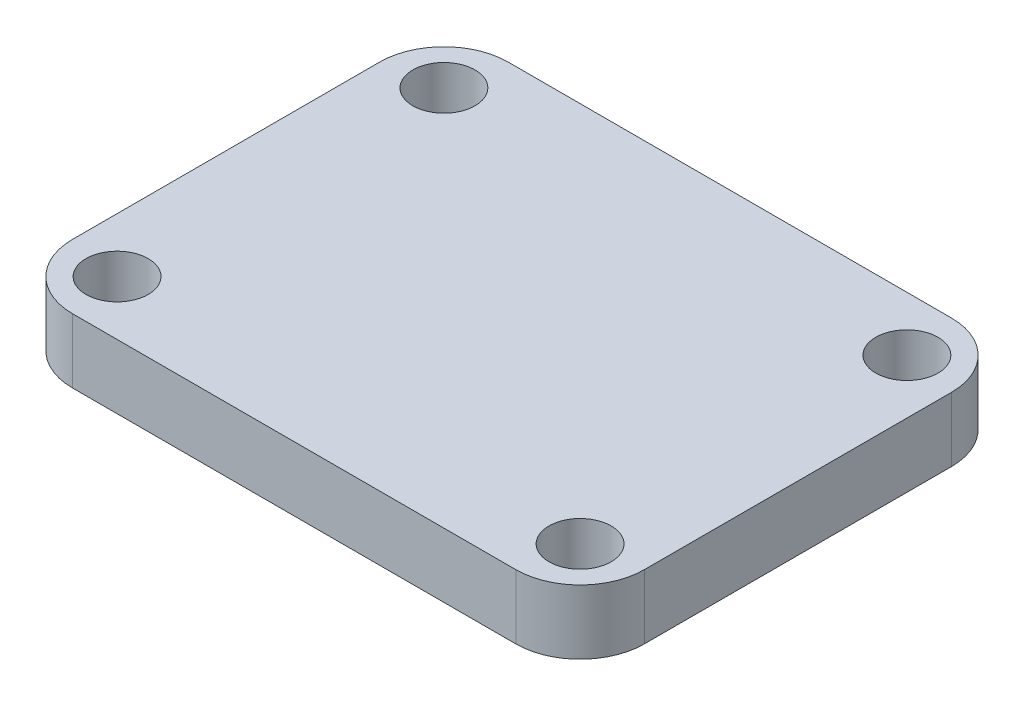
ISO-10303-21;
HEADER;
FILE_DESCRIPTION(('STEP AP214'),'2;1');
FILE_NAME('part.step','',(''),(''),'','','');
FILE_SCHEMA(('AUTOMOTIVE_DESIGN { 1 0 10303 214 1 1 1 1 }'));
ENDSEC;
DATA;
#1=APPLICATION_CONTEXT('core data for automotive mechanical design processes');
#2=APPLICATION_PROTOCOL_DEFINITION('international standard','automotive_design',2000,#1);
#3=PRODUCT_CONTEXT('',#1,'mechanical');
#4=PRODUCT('Part','Part','',(#3));
#5=PRODUCT_RELATED_PRODUCT_CATEGORY('part','',(#4));
#6=PRODUCT_DEFINITION_FORMATION('','',#4);
#7=PRODUCT_DEFINITION_CONTEXT('part definition',#1,'design');
#8=PRODUCT_DEFINITION('design','',#6,#7);
#9=PRODUCT_DEFINITION_SHAPE('','',#8);
#10=(LENGTH_UNIT() NAMED_UNIT(*) SI_UNIT(.MILLI.,.METRE.));
#11=(NAMED_UNIT(*) PLANE_ANGLE_UNIT() SI_UNIT($,.RADIAN.));
#12=(NAMED_UNIT(*) SI_UNIT($,.STERADIAN.) SOLID_ANGLE_UNIT());
#13=UNCERTAINTY_MEASURE_WITH_UNIT(LENGTH_MEASURE(1.E-05),#10,'distance_accuracy_value','');
#14=(GEOMETRIC_REPRESENTATION_CONTEXT(3) GLOBAL_UNCERTAINTY_ASSIGNED_CONTEXT((#13)) GLOBAL_UNIT_ASSIGNED_CONTEXT((#10,
#11,#12)) REPRESENTATION_CONTEXT('',''));
#15=CARTESIAN_POINT('',(0.,0.,0.));
#16=DIRECTION('',(0.,0.,1.));
#17=DIRECTION('',(1.,0.,0.));
#18=AXIS2_PLACEMENT_3D('',#15,#16,#17);
#19=CARTESIAN_POINT('',(0.,3.,0.));
#20=DIRECTION('',(0.,-1.,0.));
#21=DIRECTION('',(0.,0.,-1.));
#22=AXIS2_PLACEMENT_3D('',#19,#20,#21);
#23=PLANE('',#22);
#24=DIRECTION('',(0.,0.,1.));
#25=VECTOR('',#24,1.);
#26=CARTESIAN_POINT('',(-13.335,3.,10.16));
#27=LINE('',#26,#25);
#28=CARTESIAN_POINT('',(-13.335,3.,-7.16));
#29=VERTEX_POINT('',#28);
#30=CARTESIAN_POINT('',(-13.335,3.,7.16));
#31=VERTEX_POINT('',#30);
#32=EDGE_CURVE('E171',#29,#31,#27,.T.);
#33=ORIENTED_EDGE('',*,*,#32,.T.);
#34=CARTESIAN_POINT('',(-10.335,3.,7.16));
#35=DIRECTION('',(0.,-1.,0.));
#36=DIRECTION('',(0.,0.,-1.));
#37=AXIS2_PLACEMENT_3D('',#34,#35,#36);
#38=CIRCLE('',#37,3.);
#39=CARTESIAN_POINT('',(-10.335,3.,10.16));
#40=VERTEX_POINT('',#39);
#41=EDGE_CURVE('E148',#31,#40,#38,.F.);
#42=ORIENTED_EDGE('',*,*,#41,.T.);
#43=DIRECTION('',(1.,0.,0.));
#44=VECTOR('',#43,1.);
#45=CARTESIAN_POINT('',(-13.335,3.,10.16));
#46=LINE('',#45,#44);
#47=CARTESIAN_POINT('',(10.335,3.,10.16));
#48=VERTEX_POINT('',#47);
#49=EDGE_CURVE('E119',#40,#48,#46,.T.);
#50=ORIENTED_EDGE('',*,*,#49,.T.);
#51=CARTESIAN_POINT('',(10.335,3.,7.16));
#52=DIRECTION('',(0.,-1.,0.));
#53=DIRECTION('',(0.,0.,-1.));
#54=AXIS2_PLACEMENT_3D('',#51,#52,#53);
#55=CIRCLE('',#54,3.);
#56=CARTESIAN_POINT('',(13.335,3.,7.16));
#57=VERTEX_POINT('',#56);
#58=EDGE_CURVE('E143',#48,#57,#55,.F.);
#59=ORIENTED_EDGE('',*,*,#58,.T.);
#60=DIRECTION('',(0.,0.,-1.));
#61=VECTOR('',#60,1.);
#62=CARTESIAN_POINT('',(13.335,3.,10.16));
#63=LINE('',#62,#61);
#64=CARTESIAN_POINT('',(13.335,3.,-7.16));
#65=VERTEX_POINT('',#64);
#66=EDGE_CURVE('E126',#57,#65,#63,.T.);
#67=ORIENTED_EDGE('',*,*,#66,.T.);
#68=CARTESIAN_POINT('',(10.335,3.,-7.16));
#69=DIRECTION('',(0.,-1.,0.));
#70=DIRECTION('',(0.,0.,-1.));
#71=AXIS2_PLACEMENT_3D('',#68,#69,#70);
#72=CIRCLE('',#71,3.);
#73=CARTESIAN_POINT('',(10.335,3.,-10.16));
#74=VERTEX_POINT('',#73);
#75=EDGE_CURVE('E55',#65,#74,#72,.F.);
#76=ORIENTED_EDGE('',*,*,#75,.T.);
#77=DIRECTION('',(-1.,0.,0.));
#78=VECTOR('',#77,1.);
#79=CARTESIAN_POINT('',(-13.335,3.,-10.16));
#80=LINE('',#79,#78);
#81=CARTESIAN_POINT('',(-10.335,3.,-10.16));
#82=VERTEX_POINT('',#81);
#83=EDGE_CURVE('E129',#74,#82,#80,.T.);
#84=ORIENTED_EDGE('',*,*,#83,.T.);
#85=CARTESIAN_POINT('',(-10.335,3.,-7.16));
#86=DIRECTION('',(0.,-1.,0.));
#87=DIRECTION('',(0.,0.,-1.));
#88=AXIS2_PLACEMENT_3D('',#85,#86,#87);
#89=CIRCLE('',#88,3.);
#90=EDGE_CURVE('E146',#82,#29,#89,.F.);
#91=ORIENTED_EDGE('',*,*,#90,.T.);
#92=EDGE_LOOP('',(#33,#42,#50,#59,#67,#76,#84,#91));
#93=FACE_BOUND('',#92,.T.);
#94=CARTESIAN_POINT('',(-10.795,3.,-7.62));
#95=DIRECTION('',(0.,1.,0.));
#96=DIRECTION('',(0.,0.,1.));
#97=AXIS2_PLACEMENT_3D('',#94,#95,#96);
#98=CIRCLE('',#97,1.45);
#99=CARTESIAN_POINT('',(-10.795,3.,-6.17));
#100=VERTEX_POINT('',#99);
#101=EDGE_CURVE('E164',#100,#100,#98,.T.);
#102=ORIENTED_EDGE('',*,*,#101,.F.);
#103=EDGE_LOOP('',(#102));
#104=FACE_BOUND('',#103,.T.);
#105=CARTESIAN_POINT('',(-10.795,3.,7.62));
#106=DIRECTION('',(0.,1.,0.));
#107=DIRECTION('',(0.,0.,1.));
#108=AXIS2_PLACEMENT_3D('',#105,#106,#107);
#109=CIRCLE('',#108,1.45);
#110=CARTESIAN_POINT('',(-10.795,3.,9.07));
#111=VERTEX_POINT('',#110);
#112=EDGE_CURVE('E176',#111,#111,#109,.T.);
#113=ORIENTED_EDGE('',*,*,#112,.F.);
#114=EDGE_LOOP('',(#113));
#115=FACE_BOUND('',#114,.T.);
#116=CARTESIAN_POINT('',(10.795,3.,7.62));
#117=DIRECTION('',(0.,1.,0.));
#118=DIRECTION('',(0.,0.,1.));
#119=AXIS2_PLACEMENT_3D('',#116,#117,#118);
#120=CIRCLE('',#119,1.45);
#121=CARTESIAN_POINT('',(10.795,3.,9.07));
#122=VERTEX_POINT('',#121);
#123=EDGE_CURVE('E181',#122,#122,#120,.T.);
#124=ORIENTED_EDGE('',*,*,#123,.F.);
#125=EDGE_LOOP('',(#124));
#126=FACE_BOUND('',#125,.T.);
#127=CARTESIAN_POINT('',(10.795,3.,-7.62));
#128=DIRECTION('',(0.,1.,0.));
#129=DIRECTION('',(0.,0.,1.));
#130=AXIS2_PLACEMENT_3D('',#127,#128,#129);
#131=CIRCLE('',#130,1.45);
#132=CARTESIAN_POINT('',(10.795,3.,-6.17));
#133=VERTEX_POINT('',#132);
#134=EDGE_CURVE('E187',#133,#133,#131,.T.);
#135=ORIENTED_EDGE('',*,*,#134,.F.);
#136=EDGE_LOOP('',(#135));
#137=FACE_BOUND('',#136,.T.);
#138=ADVANCED_FACE('F33',(#93,#104,#115,#126,#137),#23,.F.);
#139=CARTESIAN_POINT('',(0.,0.,0.));
#140=DIRECTION('',(0.,-1.,0.));
#141=DIRECTION('',(0.,0.,-1.));
#142=AXIS2_PLACEMENT_3D('',#139,#140,#141);
#143=PLANE('',#142);
#144=CARTESIAN_POINT('',(10.795,0.,7.62));
#145=DIRECTION('',(0.,1.,0.));
#146=DIRECTION('',(0.,0.,1.));
#147=AXIS2_PLACEMENT_3D('',#144,#145,#146);
#148=CIRCLE('',#147,1.45);
#149=CARTESIAN_POINT('',(10.795,0.,9.07));
#150=VERTEX_POINT('',#149);
#151=EDGE_CURVE('E184',#150,#150,#148,.T.);
#152=ORIENTED_EDGE('',*,*,#151,.T.);
#153=EDGE_LOOP('',(#152));
#154=FACE_BOUND('',#153,.T.);
#155=CARTESIAN_POINT('',(-10.795,0.,-7.62));
#156=DIRECTION('',(0.,1.,0.));
#157=DIRECTION('',(0.,0.,1.));
#158=AXIS2_PLACEMENT_3D('',#155,#156,#157);
#159=CIRCLE('',#158,1.45);
#160=CARTESIAN_POINT('',(-10.795,0.,-6.17));
#161=VERTEX_POINT('',#160);
#162=EDGE_CURVE('E167',#161,#161,#159,.T.);
#163=ORIENTED_EDGE('',*,*,#162,.T.);
#164=EDGE_LOOP('',(#163));
#165=FACE_BOUND('',#164,.T.);
#166=DIRECTION('',(1.,0.,0.));
#167=VECTOR('',#166,1.);
#168=CARTESIAN_POINT('',(-13.335,0.,10.16));
#169=LINE('',#168,#167);
#170=CARTESIAN_POINT('',(-10.335,0.,10.16));
#171=VERTEX_POINT('',#170);
#172=CARTESIAN_POINT('',(10.335,0.,10.16));
#173=VERTEX_POINT('',#172);
#174=EDGE_CURVE('E116',#171,#173,#169,.T.);
#175=ORIENTED_EDGE('',*,*,#174,.F.);
#176=CARTESIAN_POINT('',(-10.335,0.,7.16));
#177=DIRECTION('',(0.,-1.,0.));
#178=DIRECTION('',(0.,0.,-1.));
#179=AXIS2_PLACEMENT_3D('',#176,#177,#178);
#180=CIRCLE('',#179,3.);
#181=CARTESIAN_POINT('',(-13.335,0.,7.16));
#182=VERTEX_POINT('',#181);
#183=EDGE_CURVE('E99',#171,#182,#180,.T.);
#184=ORIENTED_EDGE('',*,*,#183,.T.);
#185=DIRECTION('',(0.,0.,1.));
#186=VECTOR('',#185,1.);
#187=CARTESIAN_POINT('',(-13.335,0.,10.16));
#188=LINE('',#187,#186);
#189=CARTESIAN_POINT('',(-13.335,0.,-7.16));
#190=VERTEX_POINT('',#189);
#191=EDGE_CURVE('E127',#190,#182,#188,.T.);
#192=ORIENTED_EDGE('',*,*,#191,.F.);
#193=CARTESIAN_POINT('',(-10.335,0.,-7.16));
#194=DIRECTION('',(0.,-1.,0.));
#195=DIRECTION('',(0.,0.,-1.));
#196=AXIS2_PLACEMENT_3D('',#193,#194,#195);
#197=CIRCLE('',#196,3.);
#198=CARTESIAN_POINT('',(-10.335,0.,-10.16));
#199=VERTEX_POINT('',#198);
#200=EDGE_CURVE('E110',#190,#199,#197,.T.);
#201=ORIENTED_EDGE('',*,*,#200,.T.);
#202=DIRECTION('',(-1.,0.,0.));
#203=VECTOR('',#202,1.);
#204=CARTESIAN_POINT('',(-13.335,0.,-10.16));
#205=LINE('',#204,#203);
#206=CARTESIAN_POINT('',(10.335,0.,-10.16));
#207=VERTEX_POINT('',#206);
#208=EDGE_CURVE('E131',#207,#199,#205,.T.);
#209=ORIENTED_EDGE('',*,*,#208,.F.);
#210=CARTESIAN_POINT('',(10.335,0.,-7.16));
#211=DIRECTION('',(0.,-1.,0.));
#212=DIRECTION('',(0.,0.,-1.));
#213=AXIS2_PLACEMENT_3D('',#210,#211,#212);
#214=CIRCLE('',#213,3.);
#215=CARTESIAN_POINT('',(13.335,0.,-7.16));
#216=VERTEX_POINT('',#215);
#217=EDGE_CURVE('E137',#207,#216,#214,.T.);
#218=ORIENTED_EDGE('',*,*,#217,.T.);
#219=DIRECTION('',(0.,0.,-1.));
#220=VECTOR('',#219,1.);
#221=CARTESIAN_POINT('',(13.335,0.,10.16));
#222=LINE('',#221,#220);
#223=CARTESIAN_POINT('',(13.335,0.,7.16));
#224=VERTEX_POINT('',#223);
#225=EDGE_CURVE('E159',#224,#216,#222,.T.);
#226=ORIENTED_EDGE('',*,*,#225,.F.);
#227=CARTESIAN_POINT('',(10.335,0.,7.16));
#228=DIRECTION('',(0.,-1.,0.));
#229=DIRECTION('',(0.,0.,-1.));
#230=AXIS2_PLACEMENT_3D('',#227,#228,#229);
#231=CIRCLE('',#230,3.);
#232=EDGE_CURVE('E120',#224,#173,#231,.T.);
#233=ORIENTED_EDGE('',*,*,#232,.T.);
#234=EDGE_LOOP('',(#175,#184,#192,#201,#209,#218,#226,#233));
#235=FACE_BOUND('',#234,.T.);
#236=CARTESIAN_POINT('',(-10.795,0.,7.62));
#237=DIRECTION('',(0.,1.,0.));
#238=DIRECTION('',(0.,0.,1.));
#239=AXIS2_PLACEMENT_3D('',#236,#237,#238);
#240=CIRCLE('',#239,1.45);
#241=CARTESIAN_POINT('',(-10.795,0.,9.07));
#242=VERTEX_POINT('',#241);
#243=EDGE_CURVE('E178',#242,#242,#240,.T.);
#244=ORIENTED_EDGE('',*,*,#243,.T.);
#245=EDGE_LOOP('',(#244));
#246=FACE_BOUND('',#245,.T.);
#247=CARTESIAN_POINT('',(10.795,0.,-7.62));
#248=DIRECTION('',(0.,1.,0.));
#249=DIRECTION('',(0.,0.,1.));
#250=AXIS2_PLACEMENT_3D('',#247,#248,#249);
#251=CIRCLE('',#250,1.45);
#252=CARTESIAN_POINT('',(10.795,0.,-6.17));
#253=VERTEX_POINT('',#252);
#254=EDGE_CURVE('E190',#253,#253,#251,.T.);
#255=ORIENTED_EDGE('',*,*,#254,.T.);
#256=EDGE_LOOP('',(#255));
#257=FACE_BOUND('',#256,.T.);
#258=ADVANCED_FACE('F123',(#154,#165,#235,#246,#257),#143,.T.);
#259=CARTESIAN_POINT('',(13.335,3.,10.16));
#260=DIRECTION('',(-1.,0.,0.));
#261=DIRECTION('',(0.,0.,1.));
#262=AXIS2_PLACEMENT_3D('',#259,#260,#261);
#263=PLANE('',#262);
#264=ORIENTED_EDGE('',*,*,#225,.T.);
#265=DIRECTION('',(0.,-1.,0.));
#266=VECTOR('',#265,1.);
#267=CARTESIAN_POINT('',(13.335,3.,-7.16));
#268=LINE('',#267,#266);
#269=EDGE_CURVE('E11',#216,#65,#268,.F.);
#270=ORIENTED_EDGE('',*,*,#269,.T.);
#271=ORIENTED_EDGE('',*,*,#66,.F.);
#272=DIRECTION('',(0.,-1.,0.));
#273=VECTOR('',#272,1.);
#274=CARTESIAN_POINT('',(13.335,3.,7.16));
#275=LINE('',#274,#273);
#276=EDGE_CURVE('E41',#57,#224,#275,.T.);
#277=ORIENTED_EDGE('',*,*,#276,.T.);
#278=EDGE_LOOP('',(#264,#270,#271,#277));
#279=FACE_BOUND('',#278,.T.);
#280=ADVANCED_FACE('F158',(#279),#263,.F.);
#281=CARTESIAN_POINT('',(-13.335,3.,-10.16));
#282=DIRECTION('',(0.,0.,1.));
#283=DIRECTION('',(1.,0.,0.));
#284=AXIS2_PLACEMENT_3D('',#281,#282,#283);
#285=PLANE('',#284);
#286=ORIENTED_EDGE('',*,*,#208,.T.);
#287=DIRECTION('',(0.,-1.,0.));
#288=VECTOR('',#287,1.);
#289=CARTESIAN_POINT('',(-10.335,3.,-10.16));
#290=LINE('',#289,#288);
#291=EDGE_CURVE('E48',#199,#82,#290,.F.);
#292=ORIENTED_EDGE('',*,*,#291,.T.);
#293=ORIENTED_EDGE('',*,*,#83,.F.);
#294=DIRECTION('',(0.,-1.,0.));
#295=VECTOR('',#294,1.);
#296=CARTESIAN_POINT('',(10.335,3.,-10.16));
#297=LINE('',#296,#295);
#298=EDGE_CURVE('E150',#74,#207,#297,.T.);
#299=ORIENTED_EDGE('',*,*,#298,.T.);
#300=EDGE_LOOP('',(#286,#292,#293,#299));
#301=FACE_BOUND('',#300,.T.);
#302=ADVANCED_FACE('F216',(#301),#285,.F.);
#303=CARTESIAN_POINT('',(-13.335,3.,10.16));
#304=DIRECTION('',(1.,0.,0.));
#305=DIRECTION('',(0.,0.,-1.));
#306=AXIS2_PLACEMENT_3D('',#303,#304,#305);
#307=PLANE('',#306);
#308=ORIENTED_EDGE('',*,*,#191,.T.);
#309=DIRECTION('',(0.,-1.,0.));
#310=VECTOR('',#309,1.);
#311=CARTESIAN_POINT('',(-13.335,3.,7.16));
#312=LINE('',#311,#310);
#313=EDGE_CURVE('E104',#182,#31,#312,.F.);
#314=ORIENTED_EDGE('',*,*,#313,.T.);
#315=ORIENTED_EDGE('',*,*,#32,.F.);
#316=DIRECTION('',(0.,-1.,0.));
#317=VECTOR('',#316,1.);
#318=CARTESIAN_POINT('',(-13.335,3.,-7.16));
#319=LINE('',#318,#317);
#320=EDGE_CURVE('E109',#29,#190,#319,.T.);
#321=ORIENTED_EDGE('',*,*,#320,.T.);
#322=EDGE_LOOP('',(#308,#314,#315,#321));
#323=FACE_BOUND('',#322,.T.);
#324=ADVANCED_FACE('F213',(#323),#307,.F.);
#325=CARTESIAN_POINT('',(-13.335,3.,10.16));
#326=DIRECTION('',(0.,0.,-1.));
#327=DIRECTION('',(-1.,0.,0.));
#328=AXIS2_PLACEMENT_3D('',#325,#326,#327);
#329=PLANE('',#328);
#330=ORIENTED_EDGE('',*,*,#49,.F.);
#331=DIRECTION('',(0.,-1.,0.));
#332=VECTOR('',#331,1.);
#333=CARTESIAN_POINT('',(-10.335,3.,10.16));
#334=LINE('',#333,#332);
#335=EDGE_CURVE('E103',#40,#171,#334,.T.);
#336=ORIENTED_EDGE('',*,*,#335,.T.);
#337=ORIENTED_EDGE('',*,*,#174,.T.);
#338=DIRECTION('',(0.,-1.,0.));
#339=VECTOR('',#338,1.);
#340=CARTESIAN_POINT('',(10.335,3.,10.16));
#341=LINE('',#340,#339);
#342=EDGE_CURVE('E121',#173,#48,#341,.F.);
#343=ORIENTED_EDGE('',*,*,#342,.T.);
#344=EDGE_LOOP('',(#330,#336,#337,#343));
#345=FACE_BOUND('',#344,.T.);
#346=ADVANCED_FACE('F115',(#345),#329,.F.);
#347=CARTESIAN_POINT('',(-10.795,3.,-7.62));
#348=DIRECTION('',(0.,-1.,0.));
#349=DIRECTION('',(0.,0.,-1.));
#350=AXIS2_PLACEMENT_3D('',#347,#348,#349);
#351=CYLINDRICAL_SURFACE('',#350,1.45);
#352=ORIENTED_EDGE('',*,*,#101,.T.);
#353=EDGE_LOOP('',(#352));
#354=FACE_BOUND('',#353,.T.);
#355=ORIENTED_EDGE('',*,*,#162,.F.);
#356=EDGE_LOOP('',(#355));
#357=FACE_BOUND('',#356,.T.);
#358=ADVANCED_FACE('F208',(#354,#357),#351,.F.);
#359=CARTESIAN_POINT('',(-10.795,3.,7.62));
#360=DIRECTION('',(0.,-1.,0.));
#361=DIRECTION('',(0.,0.,-1.));
#362=AXIS2_PLACEMENT_3D('',#359,#360,#361);
#363=CYLINDRICAL_SURFACE('',#362,1.45);
#364=ORIENTED_EDGE('',*,*,#112,.T.);
#365=EDGE_LOOP('',(#364));
#366=FACE_BOUND('',#365,.T.);
#367=ORIENTED_EDGE('',*,*,#243,.F.);
#368=EDGE_LOOP('',(#367));
#369=FACE_BOUND('',#368,.T.);
#370=ADVANCED_FACE('F309',(#366,#369),#363,.F.);
#371=CARTESIAN_POINT('',(10.795,3.,7.62));
#372=DIRECTION('',(0.,-1.,0.));
#373=DIRECTION('',(0.,0.,-1.));
#374=AXIS2_PLACEMENT_3D('',#371,#372,#373);
#375=CYLINDRICAL_SURFACE('',#374,1.45);
#376=ORIENTED_EDGE('',*,*,#123,.T.);
#377=EDGE_LOOP('',(#376));
#378=FACE_BOUND('',#377,.T.);
#379=ORIENTED_EDGE('',*,*,#151,.F.);
#380=EDGE_LOOP('',(#379));
#381=FACE_BOUND('',#380,.T.);
#382=ADVANCED_FACE('F300',(#378,#381),#375,.F.);
#383=CARTESIAN_POINT('',(10.795,3.,-7.62));
#384=DIRECTION('',(0.,-1.,0.));
#385=DIRECTION('',(0.,0.,-1.));
#386=AXIS2_PLACEMENT_3D('',#383,#384,#385);
#387=CYLINDRICAL_SURFACE('',#386,1.45);
#388=ORIENTED_EDGE('',*,*,#134,.T.);
#389=EDGE_LOOP('',(#388));
#390=FACE_BOUND('',#389,.T.);
#391=ORIENTED_EDGE('',*,*,#254,.F.);
#392=EDGE_LOOP('',(#391));
#393=FACE_BOUND('',#392,.T.);
#394=ADVANCED_FACE('F196',(#390,#393),#387,.F.);
#395=CARTESIAN_POINT('',(-10.335,3.,7.16));
#396=DIRECTION('',(0.,-1.,0.));
#397=DIRECTION('',(0.,0.,-1.));
#398=AXIS2_PLACEMENT_3D('',#395,#396,#397);
#399=CYLINDRICAL_SURFACE('',#398,3.);
#400=ORIENTED_EDGE('',*,*,#41,.F.);
#401=ORIENTED_EDGE('',*,*,#313,.F.);
#402=ORIENTED_EDGE('',*,*,#183,.F.);
#403=ORIENTED_EDGE('',*,*,#335,.F.);
#404=EDGE_LOOP('',(#400,#401,#402,#403));
#405=FACE_BOUND('',#404,.T.);
#406=ADVANCED_FACE('F102',(#405),#399,.T.);
#407=CARTESIAN_POINT('',(-10.335,3.,-7.16));
#408=DIRECTION('',(0.,-1.,0.));
#409=DIRECTION('',(0.,0.,-1.));
#410=AXIS2_PLACEMENT_3D('',#407,#408,#409);
#411=CYLINDRICAL_SURFACE('',#410,3.);
#412=ORIENTED_EDGE('',*,*,#90,.F.);
#413=ORIENTED_EDGE('',*,*,#291,.F.);
#414=ORIENTED_EDGE('',*,*,#200,.F.);
#415=ORIENTED_EDGE('',*,*,#320,.F.);
#416=EDGE_LOOP('',(#412,#413,#414,#415));
#417=FACE_BOUND('',#416,.T.);
#418=ADVANCED_FACE('F224',(#417),#411,.T.);
#419=CARTESIAN_POINT('',(10.335,3.,-7.16));
#420=DIRECTION('',(0.,-1.,0.));
#421=DIRECTION('',(0.,0.,-1.));
#422=AXIS2_PLACEMENT_3D('',#419,#420,#421);
#423=CYLINDRICAL_SURFACE('',#422,3.);
#424=ORIENTED_EDGE('',*,*,#75,.F.);
#425=ORIENTED_EDGE('',*,*,#269,.F.);
#426=ORIENTED_EDGE('',*,*,#217,.F.);
#427=ORIENTED_EDGE('',*,*,#298,.F.);
#428=EDGE_LOOP('',(#424,#425,#426,#427));
#429=FACE_BOUND('',#428,.T.);
#430=ADVANCED_FACE('F226',(#429),#423,.T.);
#431=CARTESIAN_POINT('',(10.335,3.,7.16));
#432=DIRECTION('',(0.,-1.,0.));
#433=DIRECTION('',(0.,0.,-1.));
#434=AXIS2_PLACEMENT_3D('',#431,#432,#433);
#435=CYLINDRICAL_SURFACE('',#434,3.);
#436=ORIENTED_EDGE('',*,*,#58,.F.);
#437=ORIENTED_EDGE('',*,*,#342,.F.);
#438=ORIENTED_EDGE('',*,*,#232,.F.);
#439=ORIENTED_EDGE('',*,*,#276,.F.);
#440=EDGE_LOOP('',(#436,#437,#438,#439));
#441=FACE_BOUND('',#440,.T.);
#442=ADVANCED_FACE('F35',(#441),#435,.T.);
#443=CLOSED_SHELL('',(#138,#258,#280,#302,#324,#346,#358,#370,#382,#394,#406,#418,#430,#442));
#444=MANIFOLD_SOLID_BREP('B2',#443);
#445=ADVANCED_BREP_SHAPE_REPRESENTATION('',(#18,#444),#14);
#446=SHAPE_DEFINITION_REPRESENTATION(#9,#445);
ENDSEC;
END-ISO-10303-21;
